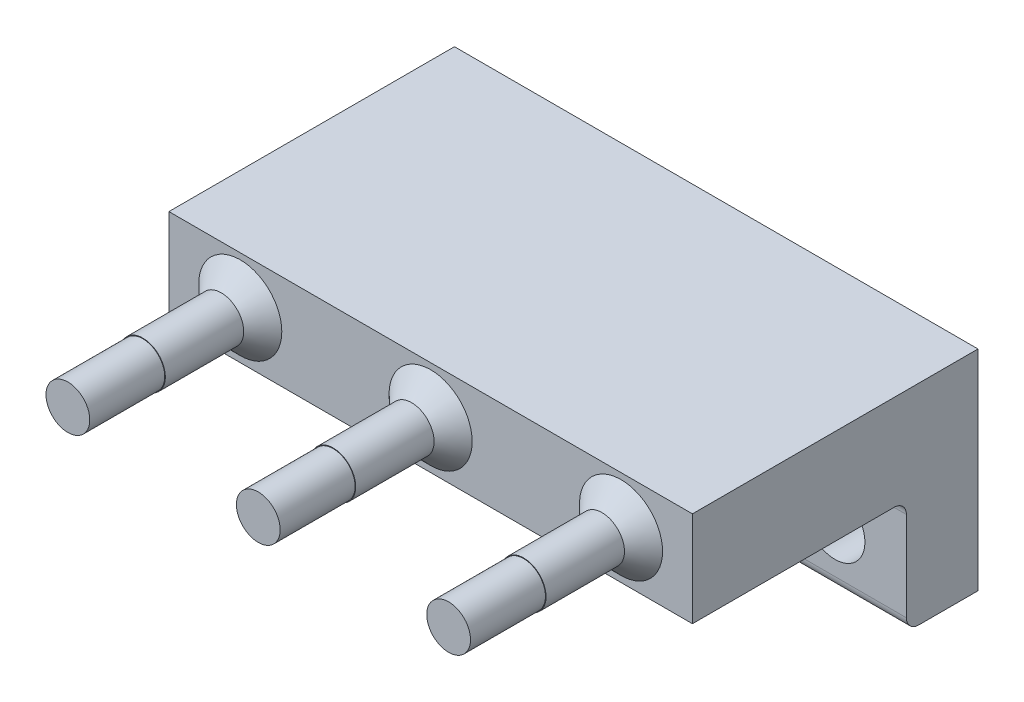
ISO-10303-21;
HEADER;
FILE_DESCRIPTION(('STEP AP214'),'2;1');
FILE_NAME('part.step','',(''),(''),'','','');
FILE_SCHEMA(('AUTOMOTIVE_DESIGN { 1 0 10303 214 1 1 1 1 }'));
ENDSEC;
DATA;
#1=APPLICATION_CONTEXT('core data for automotive mechanical design processes');
#2=APPLICATION_PROTOCOL_DEFINITION('international standard','automotive_design',2000,#1);
#3=PRODUCT_CONTEXT('',#1,'mechanical');
#4=PRODUCT('Part','Part','',(#3));
#5=PRODUCT_RELATED_PRODUCT_CATEGORY('part','',(#4));
#6=PRODUCT_DEFINITION_FORMATION('','',#4);
#7=PRODUCT_DEFINITION_CONTEXT('part definition',#1,'design');
#8=PRODUCT_DEFINITION('design','',#6,#7);
#9=PRODUCT_DEFINITION_SHAPE('','',#8);
#10=(LENGTH_UNIT() NAMED_UNIT(*) SI_UNIT(.MILLI.,.METRE.));
#11=(NAMED_UNIT(*) PLANE_ANGLE_UNIT() SI_UNIT($,.RADIAN.));
#12=(NAMED_UNIT(*) SI_UNIT($,.STERADIAN.) SOLID_ANGLE_UNIT());
#13=UNCERTAINTY_MEASURE_WITH_UNIT(LENGTH_MEASURE(1.E-05),#10,'distance_accuracy_value','');
#14=(GEOMETRIC_REPRESENTATION_CONTEXT(3) GLOBAL_UNCERTAINTY_ASSIGNED_CONTEXT((#13)) GLOBAL_UNIT_ASSIGNED_CONTEXT((#10,
#11,#12)) REPRESENTATION_CONTEXT('',''));
#15=CARTESIAN_POINT('',(0.,0.,0.));
#16=DIRECTION('',(0.,0.,1.));
#17=DIRECTION('',(1.,0.,0.));
#18=AXIS2_PLACEMENT_3D('',#15,#16,#17);
#19=CARTESIAN_POINT('',(23.8125,11.1125,0.));
#20=DIRECTION('',(0.,1.,0.));
#21=DIRECTION('',(1.,0.,0.));
#22=AXIS2_PLACEMENT_3D('',#19,#20,#21);
#23=PLANE('',#22);
#24=DIRECTION('',(-1.,0.,0.));
#25=VECTOR('',#24,1.);
#26=CARTESIAN_POINT('',(23.8125,11.1125,0.));
#27=LINE('',#26,#25);
#28=CARTESIAN_POINT('',(23.8125,11.1125,0.));
#29=VERTEX_POINT('',#28);
#30=CARTESIAN_POINT('',(-11.1125,11.1125,0.));
#31=VERTEX_POINT('',#30);
#32=EDGE_CURVE('E262',#29,#31,#27,.T.);
#33=ORIENTED_EDGE('',*,*,#32,.T.);
#34=DIRECTION('',(0.,0.,1.));
#35=VECTOR('',#34,1.);
#36=CARTESIAN_POINT('',(-11.1125,11.1125,0.));
#37=LINE('',#36,#35);
#38=CARTESIAN_POINT('',(-11.1125,11.1125,19.05));
#39=VERTEX_POINT('',#38);
#40=EDGE_CURVE('E203',#31,#39,#37,.T.);
#41=ORIENTED_EDGE('',*,*,#40,.T.);
#42=DIRECTION('',(-1.,0.,0.));
#43=VECTOR('',#42,1.);
#44=CARTESIAN_POINT('',(23.8125,11.1125,19.05));
#45=LINE('',#44,#43);
#46=CARTESIAN_POINT('',(23.8125,11.1125,19.05));
#47=VERTEX_POINT('',#46);
#48=EDGE_CURVE('E197',#47,#39,#45,.T.);
#49=ORIENTED_EDGE('',*,*,#48,.F.);
#50=DIRECTION('',(0.,0.,1.));
#51=VECTOR('',#50,1.);
#52=CARTESIAN_POINT('',(23.8125,11.1125,0.));
#53=LINE('',#52,#51);
#54=EDGE_CURVE('E201',#29,#47,#53,.T.);
#55=ORIENTED_EDGE('',*,*,#54,.F.);
#56=EDGE_LOOP('',(#33,#41,#49,#55));
#57=FACE_BOUND('',#56,.T.);
#58=ADVANCED_FACE('F17',(#57),#23,.T.);
#59=CARTESIAN_POINT('',(19.05,7.93749864998746,25.55));
#60=DIRECTION('',(0.,0.,1.));
#61=DIRECTION('',(1.,0.,0.));
#62=AXIS2_PLACEMENT_3D('',#59,#60,#61);
#63=PLANE('',#62);
#64=CARTESIAN_POINT('',(19.05,7.93749864998746,25.55));
#65=DIRECTION('',(0.,0.,-1.));
#66=DIRECTION('',(1.,0.,0.));
#67=AXIS2_PLACEMENT_3D('',#64,#65,#66);
#68=CIRCLE('',#67,1.46);
#69=CARTESIAN_POINT('',(17.59,7.93749864998746,25.55));
#70=VERTEX_POINT('',#69);
#71=EDGE_CURVE('E295',#70,#70,#68,.T.);
#72=ORIENTED_EDGE('',*,*,#71,.T.);
#73=EDGE_LOOP('',(#72));
#74=FACE_BOUND('',#73,.T.);
#75=CARTESIAN_POINT('',(19.05,7.93749864998746,25.55));
#76=DIRECTION('',(0.,0.,1.));
#77=DIRECTION('',(1.,0.,0.));
#78=AXIS2_PLACEMENT_3D('',#75,#76,#77);
#79=CIRCLE('',#78,1.5);
#80=CARTESIAN_POINT('',(17.55,7.93749864998746,25.55));
#81=VERTEX_POINT('',#80);
#82=EDGE_CURVE('E345',#81,#81,#79,.T.);
#83=ORIENTED_EDGE('',*,*,#82,.T.);
#84=EDGE_LOOP('',(#83));
#85=FACE_BOUND('',#84,.T.);
#86=ADVANCED_FACE('F19',(#74,#85),#63,.T.);
#87=CARTESIAN_POINT('',(6.35000000000015,7.93749875150671,25.55));
#88=DIRECTION('',(0.,0.,1.));
#89=DIRECTION('',(1.,0.,0.));
#90=AXIS2_PLACEMENT_3D('',#87,#88,#89);
#91=PLANE('',#90);
#92=CARTESIAN_POINT('',(6.35000000000015,7.93749875150671,25.55));
#93=DIRECTION('',(0.,0.,-1.));
#94=DIRECTION('',(1.,0.,0.));
#95=AXIS2_PLACEMENT_3D('',#92,#93,#94);
#96=CIRCLE('',#95,1.46);
#97=CARTESIAN_POINT('',(4.89000000000018,7.93749875150671,25.55));
#98=VERTEX_POINT('',#97);
#99=EDGE_CURVE('E321',#98,#98,#96,.T.);
#100=ORIENTED_EDGE('',*,*,#99,.T.);
#101=EDGE_LOOP('',(#100));
#102=FACE_BOUND('',#101,.T.);
#103=CARTESIAN_POINT('',(6.35000000000015,7.93749875150671,25.55));
#104=DIRECTION('',(0.,0.,1.));
#105=DIRECTION('',(1.,0.,0.));
#106=AXIS2_PLACEMENT_3D('',#103,#104,#105);
#107=CIRCLE('',#106,1.5);
#108=CARTESIAN_POINT('',(4.85000000000016,7.93749875150671,25.55));
#109=VERTEX_POINT('',#108);
#110=EDGE_CURVE('E357',#109,#109,#107,.T.);
#111=ORIENTED_EDGE('',*,*,#110,.T.);
#112=EDGE_LOOP('',(#111));
#113=FACE_BOUND('',#112,.T.);
#114=ADVANCED_FACE('F382',(#102,#113),#91,.T.);
#115=CARTESIAN_POINT('',(-6.35,7.93749864998746,25.55));
#116=DIRECTION('',(0.,0.,1.));
#117=DIRECTION('',(1.,0.,0.));
#118=AXIS2_PLACEMENT_3D('',#115,#116,#117);
#119=PLANE('',#118);
#120=CARTESIAN_POINT('',(-6.35,7.93749864998746,25.55));
#121=DIRECTION('',(0.,0.,-1.));
#122=DIRECTION('',(1.,0.,0.));
#123=AXIS2_PLACEMENT_3D('',#120,#121,#122);
#124=CIRCLE('',#123,1.46);
#125=CARTESIAN_POINT('',(-7.81,7.93749864998746,25.55));
#126=VERTEX_POINT('',#125);
#127=EDGE_CURVE('E332',#126,#126,#124,.T.);
#128=ORIENTED_EDGE('',*,*,#127,.T.);
#129=EDGE_LOOP('',(#128));
#130=FACE_BOUND('',#129,.T.);
#131=CARTESIAN_POINT('',(-6.35,7.93749864998746,25.55));
#132=DIRECTION('',(0.,0.,1.));
#133=DIRECTION('',(1.,0.,0.));
#134=AXIS2_PLACEMENT_3D('',#131,#132,#133);
#135=CIRCLE('',#134,1.5);
#136=CARTESIAN_POINT('',(-7.85,7.93749864998746,25.55));
#137=VERTEX_POINT('',#136);
#138=EDGE_CURVE('E26',#137,#137,#135,.T.);
#139=ORIENTED_EDGE('',*,*,#138,.T.);
#140=EDGE_LOOP('',(#139));
#141=FACE_BOUND('',#140,.T.);
#142=ADVANCED_FACE('F390',(#130,#141),#119,.T.);
#143=CARTESIAN_POINT('',(-6.35,7.93749864998746,19.05));
#144=DIRECTION('',(0.,0.,1.));
#145=DIRECTION('',(1.,0.,0.));
#146=AXIS2_PLACEMENT_3D('',#143,#144,#145);
#147=CYLINDRICAL_SURFACE('',#146,1.5);
#148=ORIENTED_EDGE('',*,*,#138,.F.);
#149=DIRECTION('',(0.,0.,-1.));
#150=VECTOR('',#149,1.);
#151=CARTESIAN_POINT('',(-7.85,7.93749864998746,19.05));
#152=LINE('',#151,#150);
#153=CARTESIAN_POINT('',(-7.85,7.93749864998746,20.32));
#154=VERTEX_POINT('',#153);
#155=EDGE_CURVE('E11',#137,#154,#152,.T.);
#156=ORIENTED_EDGE('',*,*,#155,.T.);
#157=CARTESIAN_POINT('',(-6.35,7.93749864998746,20.32));
#158=DIRECTION('',(0.,0.,-1.));
#159=DIRECTION('',(-1.,0.,0.));
#160=AXIS2_PLACEMENT_3D('',#157,#158,#159);
#161=CIRCLE('',#160,1.5);
#162=CARTESIAN_POINT('',(-4.85,7.93749864998746,20.32));
#163=VERTEX_POINT('',#162);
#164=EDGE_CURVE('E274',#163,#154,#161,.T.);
#165=ORIENTED_EDGE('',*,*,#164,.F.);
#166=CARTESIAN_POINT('',(-6.35,7.93749864998746,20.32));
#167=DIRECTION('',(0.,0.,-1.));
#168=DIRECTION('',(-1.,0.,0.));
#169=AXIS2_PLACEMENT_3D('',#166,#167,#168);
#170=CIRCLE('',#169,1.5);
#171=EDGE_CURVE('E237',#154,#163,#170,.T.);
#172=ORIENTED_EDGE('',*,*,#171,.F.);
#173=ORIENTED_EDGE('',*,*,#155,.F.);
#174=EDGE_LOOP('',(#148,#156,#165,#172,#173));
#175=FACE_BOUND('',#174,.T.);
#176=ADVANCED_FACE('F453',(#175),#147,.T.);
#177=CARTESIAN_POINT('',(-6.35,7.93749864998746,19.685));
#178=DIRECTION('',(0.,0.,-1.));
#179=DIRECTION('',(-1.,0.,0.));
#180=AXIS2_PLACEMENT_3D('',#177,#178,#179);
#181=CONICAL_SURFACE('',#180,2.135,0.785398163397448);
#182=CARTESIAN_POINT('',(-6.35,7.93749864998746,19.05));
#183=DIRECTION('',(0.,0.,1.));
#184=DIRECTION('',(-1.,0.,0.));
#185=AXIS2_PLACEMENT_3D('',#182,#183,#184);
#186=CIRCLE('',#185,2.77);
#187=CARTESIAN_POINT('',(-3.58,7.93749864998746,19.05));
#188=VERTEX_POINT('',#187);
#189=EDGE_CURVE('E341',#188,#188,#186,.T.);
#190=ORIENTED_EDGE('',*,*,#189,.T.);
#191=DIRECTION('',(-0.707106781186548,0.,0.707106781186548));
#192=VECTOR('',#191,1.);
#193=CARTESIAN_POINT('',(-4.215,7.93749864998746,19.685));
#194=LINE('',#193,#192);
#195=EDGE_CURVE('E270',#188,#163,#194,.T.);
#196=ORIENTED_EDGE('',*,*,#195,.T.);
#197=ORIENTED_EDGE('',*,*,#164,.T.);
#198=ORIENTED_EDGE('',*,*,#171,.T.);
#199=ORIENTED_EDGE('',*,*,#195,.F.);
#200=EDGE_LOOP('',(#190,#196,#197,#198,#199));
#201=FACE_BOUND('',#200,.T.);
#202=ADVANCED_FACE('F450',(#201),#181,.T.);
#203=CARTESIAN_POINT('',(6.35000000000015,7.93749875150671,19.05));
#204=DIRECTION('',(0.,0.,1.));
#205=DIRECTION('',(1.,0.,0.));
#206=AXIS2_PLACEMENT_3D('',#203,#204,#205);
#207=CYLINDRICAL_SURFACE('',#206,1.5);
#208=ORIENTED_EDGE('',*,*,#110,.F.);
#209=DIRECTION('',(0.,0.,-1.));
#210=VECTOR('',#209,1.);
#211=CARTESIAN_POINT('',(4.85000000000016,7.93749875150671,19.05));
#212=LINE('',#211,#210);
#213=CARTESIAN_POINT('',(4.85000000000016,7.93749875150671,20.32));
#214=VERTEX_POINT('',#213);
#215=EDGE_CURVE('E275',#109,#214,#212,.T.);
#216=ORIENTED_EDGE('',*,*,#215,.T.);
#217=CARTESIAN_POINT('',(6.35000000000015,7.93749875150671,20.32));
#218=DIRECTION('',(0.,0.,-1.));
#219=DIRECTION('',(-1.,0.,0.));
#220=AXIS2_PLACEMENT_3D('',#217,#218,#219);
#221=CIRCLE('',#220,1.5);
#222=CARTESIAN_POINT('',(7.85000000000017,7.93749875150671,20.32));
#223=VERTEX_POINT('',#222);
#224=EDGE_CURVE('E300',#223,#214,#221,.T.);
#225=ORIENTED_EDGE('',*,*,#224,.F.);
#226=CARTESIAN_POINT('',(6.35000000000015,7.93749875150671,20.32));
#227=DIRECTION('',(0.,0.,-1.));
#228=DIRECTION('',(-1.,0.,0.));
#229=AXIS2_PLACEMENT_3D('',#226,#227,#228);
#230=CIRCLE('',#229,1.5);
#231=EDGE_CURVE('E304',#214,#223,#230,.T.);
#232=ORIENTED_EDGE('',*,*,#231,.F.);
#233=ORIENTED_EDGE('',*,*,#215,.F.);
#234=EDGE_LOOP('',(#208,#216,#225,#232,#233));
#235=FACE_BOUND('',#234,.T.);
#236=ADVANCED_FACE('F447',(#235),#207,.T.);
#237=CARTESIAN_POINT('',(6.35000000000015,7.93749875150671,19.685));
#238=DIRECTION('',(0.,0.,-1.));
#239=DIRECTION('',(-1.,0.,0.));
#240=AXIS2_PLACEMENT_3D('',#237,#238,#239);
#241=CONICAL_SURFACE('',#240,2.135,0.785398163397448);
#242=CARTESIAN_POINT('',(6.35000000000015,7.93749875150671,19.05));
#243=DIRECTION('',(0.,0.,1.));
#244=DIRECTION('',(-1.,0.,0.));
#245=AXIS2_PLACEMENT_3D('',#242,#243,#244);
#246=CIRCLE('',#245,2.77);
#247=CARTESIAN_POINT('',(9.12000000000017,7.93749875150671,19.05));
#248=VERTEX_POINT('',#247);
#249=EDGE_CURVE('E208',#248,#248,#246,.T.);
#250=ORIENTED_EDGE('',*,*,#249,.T.);
#251=DIRECTION('',(-0.707106781186548,0.,0.707106781186548));
#252=VECTOR('',#251,1.);
#253=CARTESIAN_POINT('',(8.48500000000017,7.93749875150671,19.685));
#254=LINE('',#253,#252);
#255=EDGE_CURVE('E305',#248,#223,#254,.T.);
#256=ORIENTED_EDGE('',*,*,#255,.T.);
#257=ORIENTED_EDGE('',*,*,#224,.T.);
#258=ORIENTED_EDGE('',*,*,#231,.T.);
#259=ORIENTED_EDGE('',*,*,#255,.F.);
#260=EDGE_LOOP('',(#250,#256,#257,#258,#259));
#261=FACE_BOUND('',#260,.T.);
#262=ADVANCED_FACE('F444',(#261),#241,.T.);
#263=CARTESIAN_POINT('',(19.05,7.93749864998746,19.05));
#264=DIRECTION('',(0.,0.,1.));
#265=DIRECTION('',(1.,0.,0.));
#266=AXIS2_PLACEMENT_3D('',#263,#264,#265);
#267=CYLINDRICAL_SURFACE('',#266,1.5);
#268=ORIENTED_EDGE('',*,*,#82,.F.);
#269=DIRECTION('',(0.,0.,-1.));
#270=VECTOR('',#269,1.);
#271=CARTESIAN_POINT('',(17.55,7.93749864998746,19.05));
#272=LINE('',#271,#270);
#273=CARTESIAN_POINT('',(17.55,7.93749864998746,20.32));
#274=VERTEX_POINT('',#273);
#275=EDGE_CURVE('E349',#81,#274,#272,.T.);
#276=ORIENTED_EDGE('',*,*,#275,.T.);
#277=CARTESIAN_POINT('',(19.05,7.93749864998746,20.32));
#278=DIRECTION('',(0.,0.,-1.));
#279=DIRECTION('',(-1.,0.,0.));
#280=AXIS2_PLACEMENT_3D('',#277,#278,#279);
#281=CIRCLE('',#280,1.5);
#282=CARTESIAN_POINT('',(20.55,7.93749864998746,20.32));
#283=VERTEX_POINT('',#282);
#284=EDGE_CURVE('E246',#283,#274,#281,.T.);
#285=ORIENTED_EDGE('',*,*,#284,.F.);
#286=CARTESIAN_POINT('',(19.05,7.93749864998746,20.32));
#287=DIRECTION('',(0.,0.,-1.));
#288=DIRECTION('',(-1.,0.,0.));
#289=AXIS2_PLACEMENT_3D('',#286,#287,#288);
#290=CIRCLE('',#289,1.5);
#291=EDGE_CURVE('E209',#274,#283,#290,.T.);
#292=ORIENTED_EDGE('',*,*,#291,.F.);
#293=ORIENTED_EDGE('',*,*,#275,.F.);
#294=EDGE_LOOP('',(#268,#276,#285,#292,#293));
#295=FACE_BOUND('',#294,.T.);
#296=ADVANCED_FACE('F379',(#295),#267,.T.);
#297=CARTESIAN_POINT('',(6.35,3.175,19.05));
#298=DIRECTION('',(0.,0.,1.));
#299=DIRECTION('',(1.,0.,0.));
#300=AXIS2_PLACEMENT_3D('',#297,#298,#299);
#301=PLANE('',#300);
#302=CARTESIAN_POINT('',(19.05,7.93749864998746,19.05));
#303=DIRECTION('',(0.,0.,1.));
#304=DIRECTION('',(-1.,0.,0.));
#305=AXIS2_PLACEMENT_3D('',#302,#303,#304);
#306=CIRCLE('',#305,2.77);
#307=CARTESIAN_POINT('',(21.82,7.93749864998746,19.05));
#308=VERTEX_POINT('',#307);
#309=EDGE_CURVE('E255',#308,#308,#306,.T.);
#310=ORIENTED_EDGE('',*,*,#309,.F.);
#311=EDGE_LOOP('',(#310));
#312=FACE_BOUND('',#311,.T.);
#313=ORIENTED_EDGE('',*,*,#189,.F.);
#314=EDGE_LOOP('',(#313));
#315=FACE_BOUND('',#314,.T.);
#316=ORIENTED_EDGE('',*,*,#249,.F.);
#317=EDGE_LOOP('',(#316));
#318=FACE_BOUND('',#317,.T.);
#319=DIRECTION('',(1.,0.,0.));
#320=VECTOR('',#319,1.);
#321=CARTESIAN_POINT('',(-2.38125,4.7625,19.05));
#322=LINE('',#321,#320);
#323=CARTESIAN_POINT('',(-11.1125,4.7625,19.05));
#324=VERTEX_POINT('',#323);
#325=CARTESIAN_POINT('',(23.8125,4.7625,19.05));
#326=VERTEX_POINT('',#325);
#327=EDGE_CURVE('E214',#324,#326,#322,.T.);
#328=ORIENTED_EDGE('',*,*,#327,.T.);
#329=DIRECTION('',(0.,1.,0.));
#330=VECTOR('',#329,1.);
#331=CARTESIAN_POINT('',(23.8125,-4.7625,19.05));
#332=LINE('',#331,#330);
#333=EDGE_CURVE('E212',#326,#47,#332,.T.);
#334=ORIENTED_EDGE('',*,*,#333,.T.);
#335=ORIENTED_EDGE('',*,*,#48,.T.);
#336=DIRECTION('',(0.,-1.,0.));
#337=VECTOR('',#336,1.);
#338=CARTESIAN_POINT('',(-11.1125,11.1125,19.05));
#339=LINE('',#338,#337);
#340=EDGE_CURVE('E284',#39,#324,#339,.T.);
#341=ORIENTED_EDGE('',*,*,#340,.T.);
#342=EDGE_LOOP('',(#328,#334,#335,#341));
#343=FACE_BOUND('',#342,.T.);
#344=ADVANCED_FACE('F213',(#312,#315,#318,#343),#301,.T.);
#345=CARTESIAN_POINT('',(19.05,7.93749864998746,19.685));
#346=DIRECTION('',(0.,0.,-1.));
#347=DIRECTION('',(-1.,0.,0.));
#348=AXIS2_PLACEMENT_3D('',#345,#346,#347);
#349=CONICAL_SURFACE('',#348,2.135,0.785398163397448);
#350=ORIENTED_EDGE('',*,*,#309,.T.);
#351=DIRECTION('',(-0.707106781186548,0.,0.707106781186548));
#352=VECTOR('',#351,1.);
#353=CARTESIAN_POINT('',(21.185,7.93749864998746,19.685));
#354=LINE('',#353,#352);
#355=EDGE_CURVE('E251',#308,#283,#354,.T.);
#356=ORIENTED_EDGE('',*,*,#355,.T.);
#357=ORIENTED_EDGE('',*,*,#284,.T.);
#358=ORIENTED_EDGE('',*,*,#291,.T.);
#359=ORIENTED_EDGE('',*,*,#355,.F.);
#360=EDGE_LOOP('',(#350,#356,#357,#358,#359));
#361=FACE_BOUND('',#360,.T.);
#362=ADVANCED_FACE('F375',(#361),#349,.T.);
#363=CARTESIAN_POINT('',(-6.35,7.93749864998746,30.55));
#364=DIRECTION('',(0.,0.,1.));
#365=DIRECTION('',(1.,0.,0.));
#366=AXIS2_PLACEMENT_3D('',#363,#364,#365);
#367=PLANE('',#366);
#368=CARTESIAN_POINT('',(-6.35,7.93749864998746,30.55));
#369=DIRECTION('',(0.,0.,1.));
#370=DIRECTION('',(1.,0.,0.));
#371=AXIS2_PLACEMENT_3D('',#368,#369,#370);
#372=CIRCLE('',#371,1.46);
#373=CARTESIAN_POINT('',(-7.81,7.93749864998746,30.55));
#374=VERTEX_POINT('',#373);
#375=EDGE_CURVE('E324',#374,#374,#372,.T.);
#376=ORIENTED_EDGE('',*,*,#375,.T.);
#377=EDGE_LOOP('',(#376));
#378=FACE_BOUND('',#377,.T.);
#379=ADVANCED_FACE('F433',(#378),#367,.T.);
#380=CARTESIAN_POINT('',(-6.35,7.93749864998746,25.55));
#381=DIRECTION('',(0.,0.,1.));
#382=DIRECTION('',(1.,0.,0.));
#383=AXIS2_PLACEMENT_3D('',#380,#381,#382);
#384=CYLINDRICAL_SURFACE('',#383,1.46);
#385=ORIENTED_EDGE('',*,*,#375,.F.);
#386=DIRECTION('',(0.,0.,-1.));
#387=VECTOR('',#386,1.);
#388=CARTESIAN_POINT('',(-7.81,7.93749864998746,25.55));
#389=LINE('',#388,#387);
#390=EDGE_CURVE('E328',#374,#126,#389,.T.);
#391=ORIENTED_EDGE('',*,*,#390,.T.);
#392=ORIENTED_EDGE('',*,*,#127,.F.);
#393=ORIENTED_EDGE('',*,*,#390,.F.);
#394=EDGE_LOOP('',(#385,#391,#392,#393));
#395=FACE_BOUND('',#394,.T.);
#396=ADVANCED_FACE('F423',(#395),#384,.T.);
#397=CARTESIAN_POINT('',(6.35000000000015,7.93749875150671,30.55));
#398=DIRECTION('',(0.,0.,1.));
#399=DIRECTION('',(1.,0.,0.));
#400=AXIS2_PLACEMENT_3D('',#397,#398,#399);
#401=PLANE('',#400);
#402=CARTESIAN_POINT('',(6.35000000000015,7.93749875150671,30.55));
#403=DIRECTION('',(0.,0.,1.));
#404=DIRECTION('',(1.,0.,0.));
#405=AXIS2_PLACEMENT_3D('',#402,#403,#404);
#406=CIRCLE('',#405,1.46);
#407=CARTESIAN_POINT('',(4.89000000000018,7.93749875150671,30.55));
#408=VERTEX_POINT('',#407);
#409=EDGE_CURVE('E290',#408,#408,#406,.T.);
#410=ORIENTED_EDGE('',*,*,#409,.T.);
#411=EDGE_LOOP('',(#410));
#412=FACE_BOUND('',#411,.T.);
#413=ADVANCED_FACE('F409',(#412),#401,.T.);
#414=CARTESIAN_POINT('',(6.35000000000015,7.93749875150671,25.55));
#415=DIRECTION('',(0.,0.,1.));
#416=DIRECTION('',(1.,0.,0.));
#417=AXIS2_PLACEMENT_3D('',#414,#415,#416);
#418=CYLINDRICAL_SURFACE('',#417,1.46);
#419=ORIENTED_EDGE('',*,*,#409,.F.);
#420=DIRECTION('',(0.,0.,-1.));
#421=VECTOR('',#420,1.);
#422=CARTESIAN_POINT('',(4.89000000000018,7.93749875150671,25.55));
#423=LINE('',#422,#421);
#424=EDGE_CURVE('E294',#408,#98,#423,.T.);
#425=ORIENTED_EDGE('',*,*,#424,.T.);
#426=ORIENTED_EDGE('',*,*,#99,.F.);
#427=ORIENTED_EDGE('',*,*,#424,.F.);
#428=EDGE_LOOP('',(#419,#425,#426,#427));
#429=FACE_BOUND('',#428,.T.);
#430=ADVANCED_FACE('F400',(#429),#418,.T.);
#431=CARTESIAN_POINT('',(19.05,7.93749864998746,30.55));
#432=DIRECTION('',(0.,0.,1.));
#433=DIRECTION('',(1.,0.,0.));
#434=AXIS2_PLACEMENT_3D('',#431,#432,#433);
#435=PLANE('',#434);
#436=CARTESIAN_POINT('',(19.05,7.93749864998746,30.55));
#437=DIRECTION('',(0.,0.,1.));
#438=DIRECTION('',(1.,0.,0.));
#439=AXIS2_PLACEMENT_3D('',#436,#437,#438);
#440=CIRCLE('',#439,1.46);
#441=CARTESIAN_POINT('',(17.59,7.93749864998746,30.55));
#442=VERTEX_POINT('',#441);
#443=EDGE_CURVE('E308',#442,#442,#440,.T.);
#444=ORIENTED_EDGE('',*,*,#443,.T.);
#445=EDGE_LOOP('',(#444));
#446=FACE_BOUND('',#445,.T.);
#447=ADVANCED_FACE('F398',(#446),#435,.T.);
#448=CARTESIAN_POINT('',(19.05,7.93749864998746,25.55));
#449=DIRECTION('',(0.,0.,1.));
#450=DIRECTION('',(1.,0.,0.));
#451=AXIS2_PLACEMENT_3D('',#448,#449,#450);
#452=CYLINDRICAL_SURFACE('',#451,1.46);
#453=ORIENTED_EDGE('',*,*,#443,.F.);
#454=DIRECTION('',(0.,0.,-1.));
#455=VECTOR('',#454,1.);
#456=CARTESIAN_POINT('',(17.59,7.93749864998746,25.55));
#457=LINE('',#456,#455);
#458=EDGE_CURVE('E312',#442,#70,#457,.T.);
#459=ORIENTED_EDGE('',*,*,#458,.T.);
#460=ORIENTED_EDGE('',*,*,#71,.F.);
#461=ORIENTED_EDGE('',*,*,#458,.F.);
#462=EDGE_LOOP('',(#453,#459,#460,#461));
#463=FACE_BOUND('',#462,.T.);
#464=ADVANCED_FACE('F396',(#463),#452,.T.);
#465=CARTESIAN_POINT('',(-11.1125,4.7625,19.05));
#466=DIRECTION('',(0.,1.,0.));
#467=DIRECTION('',(1.,0.,0.));
#468=AXIS2_PLACEMENT_3D('',#465,#466,#467);
#469=PLANE('',#468);
#470=DIRECTION('',(-1.,0.,0.));
#471=VECTOR('',#470,1.);
#472=CARTESIAN_POINT('',(-2.18408298609877,4.7625,5.6007));
#473=LINE('',#472,#471);
#474=CARTESIAN_POINT('',(23.8125,4.7625,5.6007));
#475=VERTEX_POINT('',#474);
#476=CARTESIAN_POINT('',(-11.1125,4.7625,5.6007));
#477=VERTEX_POINT('',#476);
#478=EDGE_CURVE('E552',#475,#477,#473,.T.);
#479=ORIENTED_EDGE('',*,*,#478,.F.);
#480=DIRECTION('',(0.,0.,-1.));
#481=VECTOR('',#480,1.);
#482=CARTESIAN_POINT('',(23.8125,4.7625,9.525));
#483=LINE('',#482,#481);
#484=EDGE_CURVE('E218',#326,#475,#483,.T.);
#485=ORIENTED_EDGE('',*,*,#484,.F.);
#486=ORIENTED_EDGE('',*,*,#327,.F.);
#487=DIRECTION('',(0.,0.,1.));
#488=VECTOR('',#487,1.);
#489=CARTESIAN_POINT('',(-11.1125,4.7625,9.525));
#490=LINE('',#489,#488);
#491=EDGE_CURVE('E280',#477,#324,#490,.T.);
#492=ORIENTED_EDGE('',*,*,#491,.F.);
#493=EDGE_LOOP('',(#479,#485,#486,#492));
#494=FACE_BOUND('',#493,.T.);
#495=ADVANCED_FACE('F407',(#494),#469,.F.);
#496=CARTESIAN_POINT('',(6.35,0.952499999999985,4.7752));
#497=DIRECTION('',(0.,0.,-1.));
#498=DIRECTION('',(1.,0.,0.));
#499=AXIS2_PLACEMENT_3D('',#496,#497,#498);
#500=CYLINDRICAL_SURFACE('',#499,1.9939);
#501=CARTESIAN_POINT('',(6.35,0.952499999999985,4.7752));
#502=DIRECTION('',(0.,0.,-1.));
#503=DIRECTION('',(1.,0.,0.));
#504=AXIS2_PLACEMENT_3D('',#501,#502,#503);
#505=CIRCLE('',#504,1.9939);
#506=CARTESIAN_POINT('',(4.3561,0.952499999999985,4.7752));
#507=VERTEX_POINT('',#506);
#508=EDGE_CURVE('E488',#507,#507,#505,.T.);
#509=ORIENTED_EDGE('',*,*,#508,.F.);
#510=DIRECTION('',(0.,0.,-1.));
#511=VECTOR('',#510,1.);
#512=CARTESIAN_POINT('',(4.3561,0.952499999999985,4.7752));
#513=LINE('',#512,#511);
#514=CARTESIAN_POINT('',(4.3561,0.952499999999985,0.));
#515=VERTEX_POINT('',#514);
#516=EDGE_CURVE('E256',#507,#515,#513,.T.);
#517=ORIENTED_EDGE('',*,*,#516,.T.);
#518=CARTESIAN_POINT('',(6.35,0.952499999999985,0.));
#519=DIRECTION('',(0.,0.,1.));
#520=DIRECTION('',(1.,0.,0.));
#521=AXIS2_PLACEMENT_3D('',#518,#519,#520);
#522=CIRCLE('',#521,1.9939);
#523=EDGE_CURVE('E265',#515,#515,#522,.T.);
#524=ORIENTED_EDGE('',*,*,#523,.F.);
#525=ORIENTED_EDGE('',*,*,#516,.F.);
#526=EDGE_LOOP('',(#509,#517,#524,#525));
#527=FACE_BOUND('',#526,.T.);
#528=ADVANCED_FACE('F430',(#527),#500,.F.);
#529=CARTESIAN_POINT('',(19.05,0.952499999999985,4.7752));
#530=DIRECTION('',(0.,0.,-1.));
#531=DIRECTION('',(1.,0.,0.));
#532=AXIS2_PLACEMENT_3D('',#529,#530,#531);
#533=CYLINDRICAL_SURFACE('',#532,1.9939);
#534=CARTESIAN_POINT('',(19.05,0.952499999999985,4.7752));
#535=DIRECTION('',(0.,0.,-1.));
#536=DIRECTION('',(1.,0.,0.));
#537=AXIS2_PLACEMENT_3D('',#534,#535,#536);
#538=CIRCLE('',#537,1.9939);
#539=CARTESIAN_POINT('',(17.0561,0.952499999999985,4.7752));
#540=VERTEX_POINT('',#539);
#541=EDGE_CURVE('E492',#540,#540,#538,.T.);
#542=ORIENTED_EDGE('',*,*,#541,.F.);
#543=DIRECTION('',(0.,0.,-1.));
#544=VECTOR('',#543,1.);
#545=CARTESIAN_POINT('',(17.0561,0.952499999999985,4.7752));
#546=LINE('',#545,#544);
#547=CARTESIAN_POINT('',(17.0561,0.952499999999985,0.));
#548=VERTEX_POINT('',#547);
#549=EDGE_CURVE('E259',#540,#548,#546,.T.);
#550=ORIENTED_EDGE('',*,*,#549,.T.);
#551=CARTESIAN_POINT('',(19.05,0.952499999999985,0.));
#552=DIRECTION('',(0.,0.,1.));
#553=DIRECTION('',(1.,0.,0.));
#554=AXIS2_PLACEMENT_3D('',#551,#552,#553);
#555=CIRCLE('',#554,1.9939);
#556=EDGE_CURVE('E269',#548,#548,#555,.T.);
#557=ORIENTED_EDGE('',*,*,#556,.F.);
#558=ORIENTED_EDGE('',*,*,#549,.F.);
#559=EDGE_LOOP('',(#542,#550,#557,#558));
#560=FACE_BOUND('',#559,.T.);
#561=ADVANCED_FACE('F427',(#560),#533,.F.);
#562=CARTESIAN_POINT('',(-6.35,0.952499999999985,4.7752));
#563=DIRECTION('',(0.,0.,-1.));
#564=DIRECTION('',(1.,0.,0.));
#565=AXIS2_PLACEMENT_3D('',#562,#563,#564);
#566=CYLINDRICAL_SURFACE('',#565,1.9939);
#567=CARTESIAN_POINT('',(-6.35,0.952499999999985,4.7752));
#568=DIRECTION('',(0.,0.,-1.));
#569=DIRECTION('',(1.,0.,0.));
#570=AXIS2_PLACEMENT_3D('',#567,#568,#569);
#571=CIRCLE('',#570,1.9939);
#572=CARTESIAN_POINT('',(-8.3439,0.952499999999985,4.7752));
#573=VERTEX_POINT('',#572);
#574=EDGE_CURVE('E499',#573,#573,#571,.T.);
#575=ORIENTED_EDGE('',*,*,#574,.F.);
#576=DIRECTION('',(0.,0.,-1.));
#577=VECTOR('',#576,1.);
#578=CARTESIAN_POINT('',(-8.3439,0.952499999999985,4.7752));
#579=LINE('',#578,#577);
#580=CARTESIAN_POINT('',(-8.3439,0.952499999999985,0.));
#581=VERTEX_POINT('',#580);
#582=EDGE_CURVE('E289',#573,#581,#579,.T.);
#583=ORIENTED_EDGE('',*,*,#582,.T.);
#584=CARTESIAN_POINT('',(-6.35,0.952499999999985,0.));
#585=DIRECTION('',(0.,0.,1.));
#586=DIRECTION('',(1.,0.,0.));
#587=AXIS2_PLACEMENT_3D('',#584,#585,#586);
#588=CIRCLE('',#587,1.9939);
#589=EDGE_CURVE('E276',#581,#581,#588,.T.);
#590=ORIENTED_EDGE('',*,*,#589,.F.);
#591=ORIENTED_EDGE('',*,*,#582,.F.);
#592=EDGE_LOOP('',(#575,#583,#590,#591));
#593=FACE_BOUND('',#592,.T.);
#594=ADVANCED_FACE('F419',(#593),#566,.F.);
#595=CARTESIAN_POINT('',(-11.1125,11.1125,0.));
#596=DIRECTION('',(-1.,0.,0.));
#597=DIRECTION('',(0.,0.,1.));
#598=AXIS2_PLACEMENT_3D('',#595,#596,#597);
#599=PLANE('',#598);
#600=CARTESIAN_POINT('',(-11.1125,-2.032,3.9497));
#601=DIRECTION('',(1.,0.,0.));
#602=DIRECTION('',(0.,-0.707106781186548,0.707106781186548));
#603=AXIS2_PLACEMENT_3D('',#600,#601,#602);
#604=CIRCLE('',#603,0.8255);
#605=CARTESIAN_POINT('',(-11.1125,-2.032,4.7752));
#606=VERTEX_POINT('',#605);
#607=CARTESIAN_POINT('',(-11.1125,-2.8575,3.9497));
#608=VERTEX_POINT('',#607);
#609=EDGE_CURVE('E506',#606,#608,#604,.T.);
#610=ORIENTED_EDGE('',*,*,#609,.F.);
#611=DIRECTION('',(0.,1.,0.));
#612=VECTOR('',#611,1.);
#613=CARTESIAN_POINT('',(-11.1125,4.69362383258276,4.7752));
#614=LINE('',#613,#612);
#615=CARTESIAN_POINT('',(-11.1125,3.937,4.7752));
#616=VERTEX_POINT('',#615);
#617=EDGE_CURVE('E537',#606,#616,#614,.T.);
#618=ORIENTED_EDGE('',*,*,#617,.T.);
#619=CARTESIAN_POINT('',(-11.1125,3.937,5.6007));
#620=DIRECTION('',(-1.,0.,0.));
#621=DIRECTION('',(0.,0.707106781186547,-0.707106781186548));
#622=AXIS2_PLACEMENT_3D('',#619,#620,#621);
#623=CIRCLE('',#622,0.8255);
#624=EDGE_CURVE('E555',#477,#616,#623,.T.);
#625=ORIENTED_EDGE('',*,*,#624,.F.);
#626=ORIENTED_EDGE('',*,*,#491,.T.);
#627=ORIENTED_EDGE('',*,*,#340,.F.);
#628=ORIENTED_EDGE('',*,*,#40,.F.);
#629=DIRECTION('',(0.,-1.,0.));
#630=VECTOR('',#629,1.);
#631=CARTESIAN_POINT('',(-11.1125,11.1125,0.));
#632=LINE('',#631,#630);
#633=CARTESIAN_POINT('',(-11.1125,-2.8575,0.));
#634=VERTEX_POINT('',#633);
#635=EDGE_CURVE('E250',#31,#634,#632,.T.);
#636=ORIENTED_EDGE('',*,*,#635,.T.);
#637=DIRECTION('',(0.,0.,1.));
#638=VECTOR('',#637,1.);
#639=CARTESIAN_POINT('',(-11.1125,-2.8575,2.3876));
#640=LINE('',#639,#638);
#641=EDGE_CURVE('E240',#634,#608,#640,.T.);
#642=ORIENTED_EDGE('',*,*,#641,.T.);
#643=EDGE_LOOP('',(#610,#618,#625,#626,#627,#628,#636,#642));
#644=FACE_BOUND('',#643,.T.);
#645=ADVANCED_FACE('F416',(#644),#599,.T.);
#646=CARTESIAN_POINT('',(6.35,3.175,0.));
#647=DIRECTION('',(0.,0.,1.));
#648=DIRECTION('',(1.,0.,0.));
#649=AXIS2_PLACEMENT_3D('',#646,#647,#648);
#650=PLANE('',#649);
#651=ORIENTED_EDGE('',*,*,#589,.T.);
#652=EDGE_LOOP('',(#651));
#653=FACE_BOUND('',#652,.T.);
#654=ORIENTED_EDGE('',*,*,#556,.T.);
#655=EDGE_LOOP('',(#654));
#656=FACE_BOUND('',#655,.T.);
#657=ORIENTED_EDGE('',*,*,#523,.T.);
#658=EDGE_LOOP('',(#657));
#659=FACE_BOUND('',#658,.T.);
#660=DIRECTION('',(-1.,0.,0.));
#661=VECTOR('',#660,1.);
#662=CARTESIAN_POINT('',(-2.38125000000003,-2.8575,0.));
#663=LINE('',#662,#661);
#664=CARTESIAN_POINT('',(23.8125,-2.8575,0.));
#665=VERTEX_POINT('',#664);
#666=EDGE_CURVE('E243',#665,#634,#663,.T.);
#667=ORIENTED_EDGE('',*,*,#666,.T.);
#668=ORIENTED_EDGE('',*,*,#635,.F.);
#669=ORIENTED_EDGE('',*,*,#32,.F.);
#670=DIRECTION('',(0.,1.,0.));
#671=VECTOR('',#670,1.);
#672=CARTESIAN_POINT('',(23.8125,-4.7625,0.));
#673=LINE('',#672,#671);
#674=EDGE_CURVE('E224',#665,#29,#673,.T.);
#675=ORIENTED_EDGE('',*,*,#674,.F.);
#676=EDGE_LOOP('',(#667,#668,#669,#675));
#677=FACE_BOUND('',#676,.T.);
#678=ADVANCED_FACE('F414',(#653,#656,#659,#677),#650,.F.);
#679=CARTESIAN_POINT('',(-11.1125,-2.8575,4.7752));
#680=DIRECTION('',(0.,1.,0.));
#681=DIRECTION('',(1.,0.,0.));
#682=AXIS2_PLACEMENT_3D('',#679,#680,#681);
#683=PLANE('',#682);
#684=DIRECTION('',(1.,0.,0.));
#685=VECTOR('',#684,1.);
#686=CARTESIAN_POINT('',(-2.18408298609877,-2.8575,3.9497));
#687=LINE('',#686,#685);
#688=CARTESIAN_POINT('',(23.8125,-2.8575,3.9497));
#689=VERTEX_POINT('',#688);
#690=EDGE_CURVE('E369',#608,#689,#687,.T.);
#691=ORIENTED_EDGE('',*,*,#690,.F.);
#692=ORIENTED_EDGE('',*,*,#641,.F.);
#693=ORIENTED_EDGE('',*,*,#666,.F.);
#694=DIRECTION('',(0.,0.,-1.));
#695=VECTOR('',#694,1.);
#696=CARTESIAN_POINT('',(23.8125,-2.8575,2.3876));
#697=LINE('',#696,#695);
#698=EDGE_CURVE('E230',#689,#665,#697,.T.);
#699=ORIENTED_EDGE('',*,*,#698,.F.);
#700=EDGE_LOOP('',(#691,#692,#693,#699));
#701=FACE_BOUND('',#700,.T.);
#702=ADVANCED_FACE('F476',(#701),#683,.F.);
#703=CARTESIAN_POINT('',(23.8125,-4.7625,0.));
#704=DIRECTION('',(1.,0.,0.));
#705=DIRECTION('',(0.,-1.,0.));
#706=AXIS2_PLACEMENT_3D('',#703,#704,#705);
#707=PLANE('',#706);
#708=CARTESIAN_POINT('',(23.8125,-2.032,3.9497));
#709=DIRECTION('',(-1.,0.,0.));
#710=DIRECTION('',(0.,-0.707106781186548,0.707106781186548));
#711=AXIS2_PLACEMENT_3D('',#708,#709,#710);
#712=CIRCLE('',#711,0.8255);
#713=CARTESIAN_POINT('',(23.8125,-2.032,4.7752));
#714=VERTEX_POINT('',#713);
#715=EDGE_CURVE('E512',#689,#714,#712,.T.);
#716=ORIENTED_EDGE('',*,*,#715,.F.);
#717=ORIENTED_EDGE('',*,*,#698,.T.);
#718=ORIENTED_EDGE('',*,*,#674,.T.);
#719=ORIENTED_EDGE('',*,*,#54,.T.);
#720=ORIENTED_EDGE('',*,*,#333,.F.);
#721=ORIENTED_EDGE('',*,*,#484,.T.);
#722=CARTESIAN_POINT('',(23.8125,3.937,5.6007));
#723=DIRECTION('',(1.,0.,0.));
#724=DIRECTION('',(0.,0.707106781186547,-0.707106781186548));
#725=AXIS2_PLACEMENT_3D('',#722,#723,#724);
#726=CIRCLE('',#725,0.8255);
#727=CARTESIAN_POINT('',(23.8125,3.937,4.7752));
#728=VERTEX_POINT('',#727);
#729=EDGE_CURVE('E543',#728,#475,#726,.T.);
#730=ORIENTED_EDGE('',*,*,#729,.F.);
#731=DIRECTION('',(0.,-1.,0.));
#732=VECTOR('',#731,1.);
#733=CARTESIAN_POINT('',(23.8125,-3.24387616741727,4.7752));
#734=LINE('',#733,#732);
#735=EDGE_CURVE('E493',#728,#714,#734,.T.);
#736=ORIENTED_EDGE('',*,*,#735,.T.);
#737=EDGE_LOOP('',(#716,#717,#718,#719,#720,#721,#730,#736));
#738=FACE_BOUND('',#737,.T.);
#739=ADVANCED_FACE('F221',(#738),#707,.T.);
#740=CARTESIAN_POINT('',(-2.18408298609877,-2.032,3.9497));
#741=DIRECTION('',(1.,0.,0.));
#742=DIRECTION('',(0.,-0.707106781186548,0.707106781186548));
#743=AXIS2_PLACEMENT_3D('',#740,#741,#742);
#744=CYLINDRICAL_SURFACE('',#743,0.8255);
#745=ORIENTED_EDGE('',*,*,#715,.T.);
#746=DIRECTION('',(-1.,0.,0.));
#747=VECTOR('',#746,1.);
#748=CARTESIAN_POINT('',(-2.18408298609877,-2.032,4.7752));
#749=LINE('',#748,#747);
#750=EDGE_CURVE('E503',#714,#606,#749,.T.);
#751=ORIENTED_EDGE('',*,*,#750,.T.);
#752=ORIENTED_EDGE('',*,*,#609,.T.);
#753=ORIENTED_EDGE('',*,*,#690,.T.);
#754=EDGE_LOOP('',(#745,#751,#752,#753));
#755=FACE_BOUND('',#754,.T.);
#756=ADVANCED_FACE('F475',(#755),#744,.T.);
#757=CARTESIAN_POINT('',(6.74433402780248,-1.72525233483449,4.7752));
#758=DIRECTION('',(0.,0.,-1.));
#759=DIRECTION('',(0.,-1.,0.));
#760=AXIS2_PLACEMENT_3D('',#757,#758,#759);
#761=PLANE('',#760);
#762=ORIENTED_EDGE('',*,*,#574,.T.);
#763=EDGE_LOOP('',(#762));
#764=FACE_BOUND('',#763,.T.);
#765=ORIENTED_EDGE('',*,*,#541,.T.);
#766=EDGE_LOOP('',(#765));
#767=FACE_BOUND('',#766,.T.);
#768=ORIENTED_EDGE('',*,*,#508,.T.);
#769=EDGE_LOOP('',(#768));
#770=FACE_BOUND('',#769,.T.);
#771=DIRECTION('',(1.,0.,0.));
#772=VECTOR('',#771,1.);
#773=CARTESIAN_POINT('',(-2.18408298609877,3.937,4.7752));
#774=LINE('',#773,#772);
#775=EDGE_CURVE('E556',#616,#728,#774,.T.);
#776=ORIENTED_EDGE('',*,*,#775,.F.);
#777=ORIENTED_EDGE('',*,*,#617,.F.);
#778=ORIENTED_EDGE('',*,*,#750,.F.);
#779=ORIENTED_EDGE('',*,*,#735,.F.);
#780=EDGE_LOOP('',(#776,#777,#778,#779));
#781=FACE_BOUND('',#780,.T.);
#782=ADVANCED_FACE('F546',(#764,#767,#770,#781),#761,.F.);
#783=CARTESIAN_POINT('',(-2.18408298609877,3.937,5.6007));
#784=DIRECTION('',(1.,0.,0.));
#785=DIRECTION('',(0.,0.707106781186547,-0.707106781186548));
#786=AXIS2_PLACEMENT_3D('',#783,#784,#785);
#787=CYLINDRICAL_SURFACE('',#786,0.8255);
#788=ORIENTED_EDGE('',*,*,#624,.T.);
#789=ORIENTED_EDGE('',*,*,#775,.T.);
#790=ORIENTED_EDGE('',*,*,#729,.T.);
#791=ORIENTED_EDGE('',*,*,#478,.T.);
#792=EDGE_LOOP('',(#788,#789,#790,#791));
#793=FACE_BOUND('',#792,.T.);
#794=ADVANCED_FACE('F572',(#793),#787,.F.);
#795=CLOSED_SHELL('',(#58,#86,#114,#142,#176,#202,#236,#262,#296,#344,#362,#379,#396,#413,#430,
#447,#464,#495,#528,#561,#594,#645,#678,#702,#739,#756,#782,#794));
#796=MANIFOLD_SOLID_BREP('B1',#795);
#797=ADVANCED_BREP_SHAPE_REPRESENTATION('',(#18,#796),#14);
#798=SHAPE_DEFINITION_REPRESENTATION(#9,#797);
ENDSEC;
END-ISO-10303-21;
